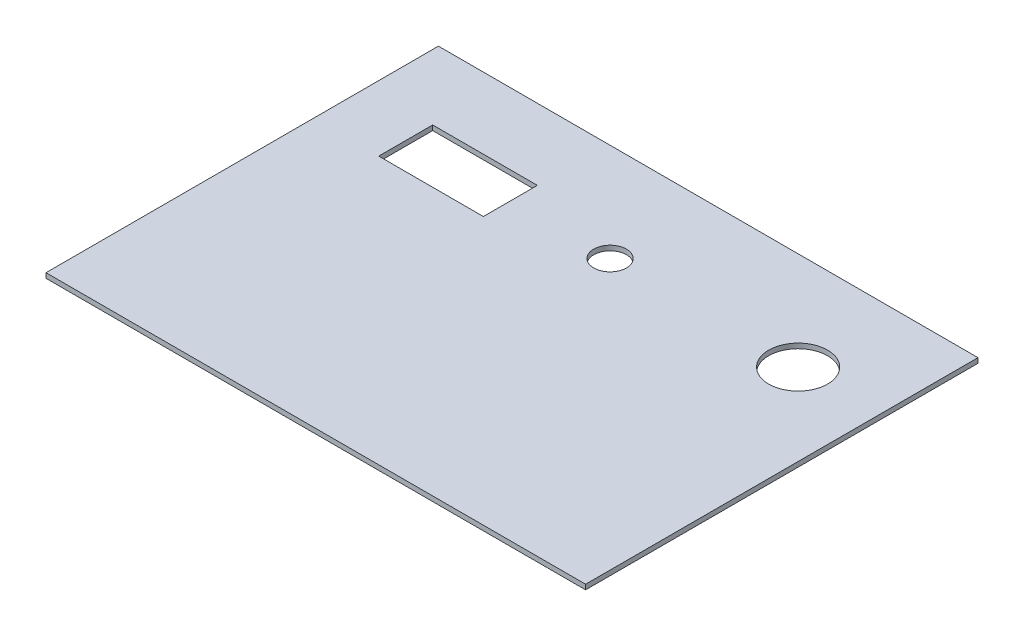
ISO-10303-21;
HEADER;
FILE_DESCRIPTION(('STEP AP214'),'2;1');
FILE_NAME('part.step','',(''),(''),'','','');
FILE_SCHEMA(('AUTOMOTIVE_DESIGN { 1 0 10303 214 1 1 1 1 }'));
ENDSEC;
DATA;
#1=APPLICATION_CONTEXT('core data for automotive mechanical design processes');
#2=APPLICATION_PROTOCOL_DEFINITION('international standard','automotive_design',2000,#1);
#3=PRODUCT_CONTEXT('',#1,'mechanical');
#4=PRODUCT('Part','Part','',(#3));
#5=PRODUCT_RELATED_PRODUCT_CATEGORY('part','',(#4));
#6=PRODUCT_DEFINITION_FORMATION('','',#4);
#7=PRODUCT_DEFINITION_CONTEXT('part definition',#1,'design');
#8=PRODUCT_DEFINITION('design','',#6,#7);
#9=PRODUCT_DEFINITION_SHAPE('','',#8);
#10=(LENGTH_UNIT() NAMED_UNIT(*) SI_UNIT(.MILLI.,.METRE.));
#11=(NAMED_UNIT(*) PLANE_ANGLE_UNIT() SI_UNIT($,.RADIAN.));
#12=(NAMED_UNIT(*) SI_UNIT($,.STERADIAN.) SOLID_ANGLE_UNIT());
#13=UNCERTAINTY_MEASURE_WITH_UNIT(LENGTH_MEASURE(1.E-05),#10,'distance_accuracy_value','');
#14=(GEOMETRIC_REPRESENTATION_CONTEXT(3) GLOBAL_UNCERTAINTY_ASSIGNED_CONTEXT((#13)) GLOBAL_UNIT_ASSIGNED_CONTEXT((#10,
#11,#12)) REPRESENTATION_CONTEXT('',''));
#15=CARTESIAN_POINT('',(0.,0.,0.));
#16=DIRECTION('',(0.,0.,1.));
#17=DIRECTION('',(1.,0.,0.));
#18=AXIS2_PLACEMENT_3D('',#15,#16,#17);
#19=CARTESIAN_POINT('',(0.,3.,0.));
#20=DIRECTION('',(0.,1.,0.));
#21=DIRECTION('',(0.,0.,1.));
#22=AXIS2_PLACEMENT_3D('',#19,#20,#21);
#23=PLANE('',#22);
#24=DIRECTION('',(1.,0.,0.));
#25=VECTOR('',#24,1.);
#26=CARTESIAN_POINT('',(40.,3.,76.5));
#27=LINE('',#26,#25);
#28=CARTESIAN_POINT('',(40.,3.,76.5));
#29=VERTEX_POINT('',#28);
#30=CARTESIAN_POINT('',(104.,3.,76.5));
#31=VERTEX_POINT('',#30);
#32=EDGE_CURVE('E114',#29,#31,#27,.T.);
#33=ORIENTED_EDGE('',*,*,#32,.F.);
#34=DIRECTION('',(0.,0.,1.));
#35=VECTOR('',#34,1.);
#36=CARTESIAN_POINT('',(40.,3.,43.5));
#37=LINE('',#36,#35);
#38=CARTESIAN_POINT('',(40.,3.,43.5));
#39=VERTEX_POINT('',#38);
#40=EDGE_CURVE('E105',#39,#29,#37,.T.);
#41=ORIENTED_EDGE('',*,*,#40,.F.);
#42=DIRECTION('',(-1.,0.,0.));
#43=VECTOR('',#42,1.);
#44=CARTESIAN_POINT('',(40.,3.,43.5));
#45=LINE('',#44,#43);
#46=CARTESIAN_POINT('',(104.,3.,43.5));
#47=VERTEX_POINT('',#46);
#48=EDGE_CURVE('E132',#47,#39,#45,.T.);
#49=ORIENTED_EDGE('',*,*,#48,.F.);
#50=DIRECTION('',(0.,0.,-1.));
#51=VECTOR('',#50,1.);
#52=CARTESIAN_POINT('',(104.,3.,43.5));
#53=LINE('',#52,#51);
#54=EDGE_CURVE('E128',#31,#47,#53,.T.);
#55=ORIENTED_EDGE('',*,*,#54,.F.);
#56=EDGE_LOOP('',(#33,#41,#49,#55));
#57=FACE_BOUND('',#56,.T.);
#58=CARTESIAN_POINT('',(280.,3.,60.));
#59=DIRECTION('',(0.,1.,0.));
#60=DIRECTION('',(0.,0.,1.));
#61=AXIS2_PLACEMENT_3D('',#58,#59,#60);
#62=CIRCLE('',#61,18.);
#63=CARTESIAN_POINT('',(280.,3.,78.));
#64=VERTEX_POINT('',#63);
#65=EDGE_CURVE('E156',#64,#64,#62,.T.);
#66=ORIENTED_EDGE('',*,*,#65,.F.);
#67=EDGE_LOOP('',(#66));
#68=FACE_BOUND('',#67,.T.);
#69=DIRECTION('',(0.,0.,1.));
#70=VECTOR('',#69,1.);
#71=CARTESIAN_POINT('',(0.,3.,0.));
#72=LINE('',#71,#70);
#73=CARTESIAN_POINT('',(0.,3.,0.));
#74=VERTEX_POINT('',#73);
#75=CARTESIAN_POINT('',(0.,3.,240.));
#76=VERTEX_POINT('',#75);
#77=EDGE_CURVE('E164',#74,#76,#72,.T.);
#78=ORIENTED_EDGE('',*,*,#77,.T.);
#79=DIRECTION('',(1.,0.,0.));
#80=VECTOR('',#79,1.);
#81=CARTESIAN_POINT('',(0.,3.,240.));
#82=LINE('',#81,#80);
#83=CARTESIAN_POINT('',(330.,3.,240.));
#84=VERTEX_POINT('',#83);
#85=EDGE_CURVE('E168',#76,#84,#82,.T.);
#86=ORIENTED_EDGE('',*,*,#85,.T.);
#87=DIRECTION('',(0.,0.,-1.));
#88=VECTOR('',#87,1.);
#89=CARTESIAN_POINT('',(330.,3.,0.));
#90=LINE('',#89,#88);
#91=CARTESIAN_POINT('',(330.,3.,0.));
#92=VERTEX_POINT('',#91);
#93=EDGE_CURVE('E172',#84,#92,#90,.T.);
#94=ORIENTED_EDGE('',*,*,#93,.T.);
#95=DIRECTION('',(-1.,0.,0.));
#96=VECTOR('',#95,1.);
#97=CARTESIAN_POINT('',(0.,3.,0.));
#98=LINE('',#97,#96);
#99=EDGE_CURVE('E175',#92,#74,#98,.T.);
#100=ORIENTED_EDGE('',*,*,#99,.T.);
#101=EDGE_LOOP('',(#78,#86,#94,#100));
#102=FACE_BOUND('',#101,.T.);
#103=CARTESIAN_POINT('',(165.,3.,60.));
#104=DIRECTION('',(0.,1.,0.));
#105=DIRECTION('',(0.,0.,1.));
#106=AXIS2_PLACEMENT_3D('',#103,#104,#105);
#107=CIRCLE('',#106,10.);
#108=CARTESIAN_POINT('',(165.,3.,70.));
#109=VERTEX_POINT('',#108);
#110=EDGE_CURVE('E140',#109,#109,#107,.T.);
#111=ORIENTED_EDGE('',*,*,#110,.F.);
#112=EDGE_LOOP('',(#111));
#113=FACE_BOUND('',#112,.T.);
#114=ADVANCED_FACE('F39',(#57,#68,#102,#113),#23,.T.);
#115=CARTESIAN_POINT('',(0.,0.,0.));
#116=DIRECTION('',(0.,1.,0.));
#117=DIRECTION('',(0.,0.,1.));
#118=AXIS2_PLACEMENT_3D('',#115,#116,#117);
#119=PLANE('',#118);
#120=CARTESIAN_POINT('',(280.,0.,60.));
#121=DIRECTION('',(0.,1.,0.));
#122=DIRECTION('',(0.,0.,1.));
#123=AXIS2_PLACEMENT_3D('',#120,#121,#122);
#124=CIRCLE('',#123,18.);
#125=CARTESIAN_POINT('',(280.,0.,78.));
#126=VERTEX_POINT('',#125);
#127=EDGE_CURVE('E123',#126,#126,#124,.T.);
#128=ORIENTED_EDGE('',*,*,#127,.T.);
#129=EDGE_LOOP('',(#128));
#130=FACE_BOUND('',#129,.T.);
#131=DIRECTION('',(0.,0.,1.));
#132=VECTOR('',#131,1.);
#133=CARTESIAN_POINT('',(0.,0.,0.));
#134=LINE('',#133,#132);
#135=CARTESIAN_POINT('',(0.,0.,0.));
#136=VERTEX_POINT('',#135);
#137=CARTESIAN_POINT('',(0.,0.,240.));
#138=VERTEX_POINT('',#137);
#139=EDGE_CURVE('E160',#136,#138,#134,.T.);
#140=ORIENTED_EDGE('',*,*,#139,.F.);
#141=DIRECTION('',(-1.,0.,0.));
#142=VECTOR('',#141,1.);
#143=CARTESIAN_POINT('',(0.,0.,0.));
#144=LINE('',#143,#142);
#145=CARTESIAN_POINT('',(330.,0.,0.));
#146=VERTEX_POINT('',#145);
#147=EDGE_CURVE('E169',#146,#136,#144,.T.);
#148=ORIENTED_EDGE('',*,*,#147,.F.);
#149=DIRECTION('',(0.,0.,-1.));
#150=VECTOR('',#149,1.);
#151=CARTESIAN_POINT('',(330.,0.,0.));
#152=LINE('',#151,#150);
#153=CARTESIAN_POINT('',(330.,0.,240.));
#154=VERTEX_POINT('',#153);
#155=EDGE_CURVE('E185',#154,#146,#152,.T.);
#156=ORIENTED_EDGE('',*,*,#155,.F.);
#157=DIRECTION('',(1.,0.,0.));
#158=VECTOR('',#157,1.);
#159=CARTESIAN_POINT('',(0.,0.,240.));
#160=LINE('',#159,#158);
#161=EDGE_CURVE('E182',#138,#154,#160,.T.);
#162=ORIENTED_EDGE('',*,*,#161,.F.);
#163=EDGE_LOOP('',(#140,#148,#156,#162));
#164=FACE_BOUND('',#163,.T.);
#165=DIRECTION('',(0.,0.,1.));
#166=VECTOR('',#165,1.);
#167=CARTESIAN_POINT('',(40.,0.,43.5));
#168=LINE('',#167,#166);
#169=CARTESIAN_POINT('',(40.,0.,43.5));
#170=VERTEX_POINT('',#169);
#171=CARTESIAN_POINT('',(40.,0.,76.5));
#172=VERTEX_POINT('',#171);
#173=EDGE_CURVE('E63',#170,#172,#168,.T.);
#174=ORIENTED_EDGE('',*,*,#173,.T.);
#175=DIRECTION('',(1.,0.,0.));
#176=VECTOR('',#175,1.);
#177=CARTESIAN_POINT('',(40.,0.,76.5));
#178=LINE('',#177,#176);
#179=CARTESIAN_POINT('',(104.,0.,76.5));
#180=VERTEX_POINT('',#179);
#181=EDGE_CURVE('E121',#172,#180,#178,.T.);
#182=ORIENTED_EDGE('',*,*,#181,.T.);
#183=DIRECTION('',(0.,0.,-1.));
#184=VECTOR('',#183,1.);
#185=CARTESIAN_POINT('',(104.,0.,43.5));
#186=LINE('',#185,#184);
#187=CARTESIAN_POINT('',(104.,0.,43.5));
#188=VERTEX_POINT('',#187);
#189=EDGE_CURVE('E143',#180,#188,#186,.T.);
#190=ORIENTED_EDGE('',*,*,#189,.T.);
#191=DIRECTION('',(-1.,0.,0.));
#192=VECTOR('',#191,1.);
#193=CARTESIAN_POINT('',(40.,0.,43.5));
#194=LINE('',#193,#192);
#195=EDGE_CURVE('E115',#188,#170,#194,.T.);
#196=ORIENTED_EDGE('',*,*,#195,.T.);
#197=EDGE_LOOP('',(#174,#182,#190,#196));
#198=FACE_BOUND('',#197,.T.);
#199=CARTESIAN_POINT('',(165.,0.,60.));
#200=DIRECTION('',(0.,1.,0.));
#201=DIRECTION('',(0.,0.,1.));
#202=AXIS2_PLACEMENT_3D('',#199,#200,#201);
#203=CIRCLE('',#202,10.);
#204=CARTESIAN_POINT('',(165.,0.,70.));
#205=VERTEX_POINT('',#204);
#206=EDGE_CURVE('E270',#205,#205,#203,.T.);
#207=ORIENTED_EDGE('',*,*,#206,.T.);
#208=EDGE_LOOP('',(#207));
#209=FACE_BOUND('',#208,.T.);
#210=ADVANCED_FACE('F208',(#130,#164,#198,#209),#119,.F.);
#211=CARTESIAN_POINT('',(0.,3.,0.));
#212=DIRECTION('',(1.,0.,0.));
#213=DIRECTION('',(0.,0.,-1.));
#214=AXIS2_PLACEMENT_3D('',#211,#212,#213);
#215=PLANE('',#214);
#216=ORIENTED_EDGE('',*,*,#139,.T.);
#217=DIRECTION('',(0.,-1.,0.));
#218=VECTOR('',#217,1.);
#219=CARTESIAN_POINT('',(0.,3.,240.));
#220=LINE('',#219,#218);
#221=EDGE_CURVE('E11',#76,#138,#220,.T.);
#222=ORIENTED_EDGE('',*,*,#221,.F.);
#223=ORIENTED_EDGE('',*,*,#77,.F.);
#224=DIRECTION('',(0.,-1.,0.));
#225=VECTOR('',#224,1.);
#226=CARTESIAN_POINT('',(0.,3.,0.));
#227=LINE('',#226,#225);
#228=EDGE_CURVE('E178',#74,#136,#227,.T.);
#229=ORIENTED_EDGE('',*,*,#228,.T.);
#230=EDGE_LOOP('',(#216,#222,#223,#229));
#231=FACE_BOUND('',#230,.T.);
#232=ADVANCED_FACE('F41',(#231),#215,.F.);
#233=CARTESIAN_POINT('',(0.,3.,240.));
#234=DIRECTION('',(0.,0.,-1.));
#235=DIRECTION('',(-1.,0.,0.));
#236=AXIS2_PLACEMENT_3D('',#233,#234,#235);
#237=PLANE('',#236);
#238=ORIENTED_EDGE('',*,*,#161,.T.);
#239=DIRECTION('',(0.,-1.,0.));
#240=VECTOR('',#239,1.);
#241=CARTESIAN_POINT('',(330.,3.,240.));
#242=LINE('',#241,#240);
#243=EDGE_CURVE('E48',#84,#154,#242,.T.);
#244=ORIENTED_EDGE('',*,*,#243,.F.);
#245=ORIENTED_EDGE('',*,*,#85,.F.);
#246=ORIENTED_EDGE('',*,*,#221,.T.);
#247=EDGE_LOOP('',(#238,#244,#245,#246));
#248=FACE_BOUND('',#247,.T.);
#249=ADVANCED_FACE('F219',(#248),#237,.F.);
#250=CARTESIAN_POINT('',(330.,3.,0.));
#251=DIRECTION('',(-1.,0.,0.));
#252=DIRECTION('',(0.,0.,1.));
#253=AXIS2_PLACEMENT_3D('',#250,#251,#252);
#254=PLANE('',#253);
#255=ORIENTED_EDGE('',*,*,#155,.T.);
#256=DIRECTION('',(0.,-1.,0.));
#257=VECTOR('',#256,1.);
#258=CARTESIAN_POINT('',(330.,3.,0.));
#259=LINE('',#258,#257);
#260=EDGE_CURVE('E193',#92,#146,#259,.T.);
#261=ORIENTED_EDGE('',*,*,#260,.F.);
#262=ORIENTED_EDGE('',*,*,#93,.F.);
#263=ORIENTED_EDGE('',*,*,#243,.T.);
#264=EDGE_LOOP('',(#255,#261,#262,#263));
#265=FACE_BOUND('',#264,.T.);
#266=ADVANCED_FACE('F202',(#265),#254,.F.);
#267=CARTESIAN_POINT('',(0.,3.,0.));
#268=DIRECTION('',(0.,0.,1.));
#269=DIRECTION('',(1.,0.,0.));
#270=AXIS2_PLACEMENT_3D('',#267,#268,#269);
#271=PLANE('',#270);
#272=ORIENTED_EDGE('',*,*,#147,.T.);
#273=ORIENTED_EDGE('',*,*,#228,.F.);
#274=ORIENTED_EDGE('',*,*,#99,.F.);
#275=ORIENTED_EDGE('',*,*,#260,.T.);
#276=EDGE_LOOP('',(#272,#273,#274,#275));
#277=FACE_BOUND('',#276,.T.);
#278=ADVANCED_FACE('F212',(#277),#271,.F.);
#279=CARTESIAN_POINT('',(280.,3.,60.));
#280=DIRECTION('',(0.,-1.,0.));
#281=DIRECTION('',(0.,0.,-1.));
#282=AXIS2_PLACEMENT_3D('',#279,#280,#281);
#283=CYLINDRICAL_SURFACE('',#282,18.);
#284=ORIENTED_EDGE('',*,*,#65,.T.);
#285=EDGE_LOOP('',(#284));
#286=FACE_BOUND('',#285,.T.);
#287=ORIENTED_EDGE('',*,*,#127,.F.);
#288=EDGE_LOOP('',(#287));
#289=FACE_BOUND('',#288,.T.);
#290=ADVANCED_FACE('F234',(#286,#289),#283,.F.);
#291=CARTESIAN_POINT('',(40.,3.,43.5));
#292=DIRECTION('',(1.,0.,0.));
#293=DIRECTION('',(0.,0.,-1.));
#294=AXIS2_PLACEMENT_3D('',#291,#292,#293);
#295=PLANE('',#294);
#296=ORIENTED_EDGE('',*,*,#173,.F.);
#297=DIRECTION('',(0.,-1.,0.));
#298=VECTOR('',#297,1.);
#299=CARTESIAN_POINT('',(40.,3.,43.5));
#300=LINE('',#299,#298);
#301=EDGE_CURVE('E109',#39,#170,#300,.T.);
#302=ORIENTED_EDGE('',*,*,#301,.F.);
#303=ORIENTED_EDGE('',*,*,#40,.T.);
#304=DIRECTION('',(0.,-1.,0.));
#305=VECTOR('',#304,1.);
#306=CARTESIAN_POINT('',(40.,3.,76.5));
#307=LINE('',#306,#305);
#308=EDGE_CURVE('E108',#29,#172,#307,.T.);
#309=ORIENTED_EDGE('',*,*,#308,.T.);
#310=EDGE_LOOP('',(#296,#302,#303,#309));
#311=FACE_BOUND('',#310,.T.);
#312=ADVANCED_FACE('F107',(#311),#295,.T.);
#313=CARTESIAN_POINT('',(40.,3.,76.5));
#314=DIRECTION('',(0.,0.,-1.));
#315=DIRECTION('',(-1.,0.,0.));
#316=AXIS2_PLACEMENT_3D('',#313,#314,#315);
#317=PLANE('',#316);
#318=ORIENTED_EDGE('',*,*,#181,.F.);
#319=ORIENTED_EDGE('',*,*,#308,.F.);
#320=ORIENTED_EDGE('',*,*,#32,.T.);
#321=DIRECTION('',(0.,-1.,0.));
#322=VECTOR('',#321,1.);
#323=CARTESIAN_POINT('',(104.,3.,76.5));
#324=LINE('',#323,#322);
#325=EDGE_CURVE('E124',#31,#180,#324,.T.);
#326=ORIENTED_EDGE('',*,*,#325,.T.);
#327=EDGE_LOOP('',(#318,#319,#320,#326));
#328=FACE_BOUND('',#327,.T.);
#329=ADVANCED_FACE('F118',(#328),#317,.T.);
#330=CARTESIAN_POINT('',(104.,3.,43.5));
#331=DIRECTION('',(-1.,0.,0.));
#332=DIRECTION('',(0.,0.,1.));
#333=AXIS2_PLACEMENT_3D('',#330,#331,#332);
#334=PLANE('',#333);
#335=ORIENTED_EDGE('',*,*,#189,.F.);
#336=ORIENTED_EDGE('',*,*,#325,.F.);
#337=ORIENTED_EDGE('',*,*,#54,.T.);
#338=DIRECTION('',(0.,-1.,0.));
#339=VECTOR('',#338,1.);
#340=CARTESIAN_POINT('',(104.,3.,43.5));
#341=LINE('',#340,#339);
#342=EDGE_CURVE('E55',#47,#188,#341,.T.);
#343=ORIENTED_EDGE('',*,*,#342,.T.);
#344=EDGE_LOOP('',(#335,#336,#337,#343));
#345=FACE_BOUND('',#344,.T.);
#346=ADVANCED_FACE('F251',(#345),#334,.T.);
#347=CARTESIAN_POINT('',(40.,3.,43.5));
#348=DIRECTION('',(0.,0.,1.));
#349=DIRECTION('',(1.,0.,0.));
#350=AXIS2_PLACEMENT_3D('',#347,#348,#349);
#351=PLANE('',#350);
#352=ORIENTED_EDGE('',*,*,#195,.F.);
#353=ORIENTED_EDGE('',*,*,#342,.F.);
#354=ORIENTED_EDGE('',*,*,#48,.T.);
#355=ORIENTED_EDGE('',*,*,#301,.T.);
#356=EDGE_LOOP('',(#352,#353,#354,#355));
#357=FACE_BOUND('',#356,.T.);
#358=ADVANCED_FACE('F256',(#357),#351,.T.);
#359=CARTESIAN_POINT('',(165.,3.,60.));
#360=DIRECTION('',(0.,-1.,0.));
#361=DIRECTION('',(0.,0.,-1.));
#362=AXIS2_PLACEMENT_3D('',#359,#360,#361);
#363=CYLINDRICAL_SURFACE('',#362,10.);
#364=ORIENTED_EDGE('',*,*,#110,.T.);
#365=EDGE_LOOP('',(#364));
#366=FACE_BOUND('',#365,.T.);
#367=ORIENTED_EDGE('',*,*,#206,.F.);
#368=EDGE_LOOP('',(#367));
#369=FACE_BOUND('',#368,.T.);
#370=ADVANCED_FACE('F260',(#366,#369),#363,.F.);
#371=CLOSED_SHELL('',(#114,#210,#232,#249,#266,#278,#290,#312,#329,#346,#358,#370));
#372=MANIFOLD_SOLID_BREP('B2',#371);
#373=ADVANCED_BREP_SHAPE_REPRESENTATION('',(#18,#372),#14);
#374=SHAPE_DEFINITION_REPRESENTATION(#9,#373);
ENDSEC;
END-ISO-10303-21;
